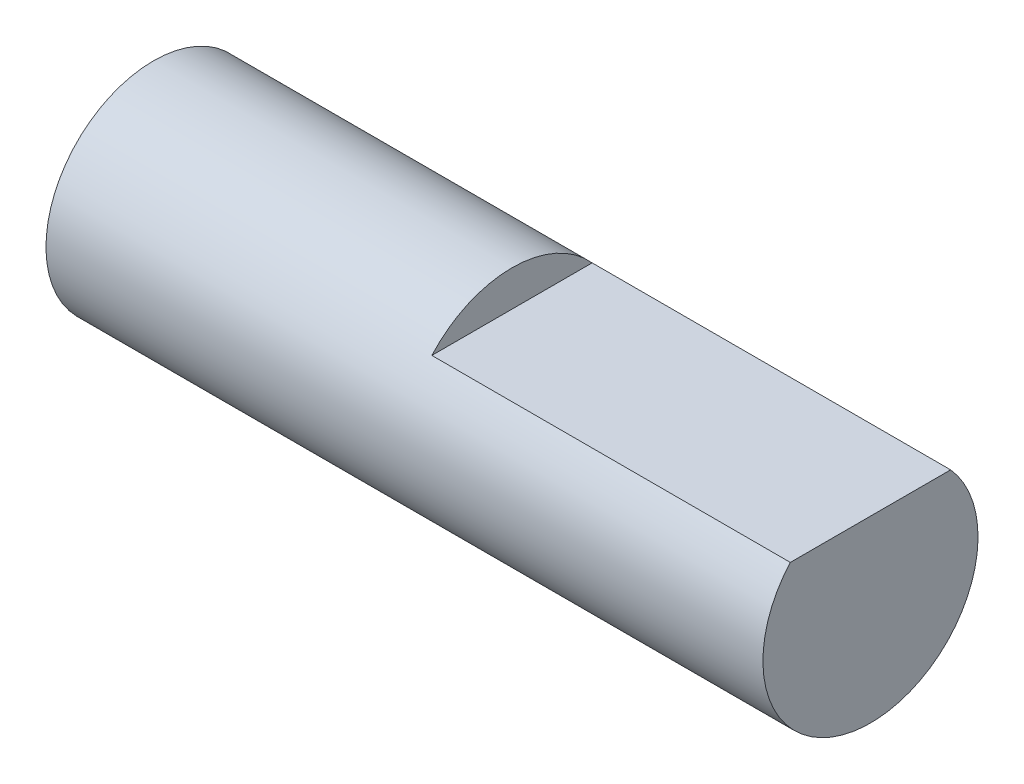
ISO-10303-21;
HEADER;
FILE_DESCRIPTION(('STEP AP214'),'2;1');
FILE_NAME('part.step','',(''),(''),'','','');
FILE_SCHEMA(('AUTOMOTIVE_DESIGN { 1 0 10303 214 1 1 1 1 }'));
ENDSEC;
DATA;
#1=APPLICATION_CONTEXT('core data for automotive mechanical design processes');
#2=APPLICATION_PROTOCOL_DEFINITION('international standard','automotive_design',2000,#1);
#3=PRODUCT_CONTEXT('',#1,'mechanical');
#4=PRODUCT('Part','Part','',(#3));
#5=PRODUCT_RELATED_PRODUCT_CATEGORY('part','',(#4));
#6=PRODUCT_DEFINITION_FORMATION('','',#4);
#7=PRODUCT_DEFINITION_CONTEXT('part definition',#1,'design');
#8=PRODUCT_DEFINITION('design','',#6,#7);
#9=PRODUCT_DEFINITION_SHAPE('','',#8);
#10=(LENGTH_UNIT() NAMED_UNIT(*) SI_UNIT(.MILLI.,.METRE.));
#11=(NAMED_UNIT(*) PLANE_ANGLE_UNIT() SI_UNIT($,.RADIAN.));
#12=(NAMED_UNIT(*) SI_UNIT($,.STERADIAN.) SOLID_ANGLE_UNIT());
#13=UNCERTAINTY_MEASURE_WITH_UNIT(LENGTH_MEASURE(1.E-05),#10,'distance_accuracy_value','');
#14=(GEOMETRIC_REPRESENTATION_CONTEXT(3) GLOBAL_UNCERTAINTY_ASSIGNED_CONTEXT((#13)) GLOBAL_UNIT_ASSIGNED_CONTEXT((#10,
#11,#12)) REPRESENTATION_CONTEXT('',''));
#15=CARTESIAN_POINT('',(0.,0.,0.));
#16=DIRECTION('',(0.,0.,1.));
#17=DIRECTION('',(1.,0.,0.));
#18=AXIS2_PLACEMENT_3D('',#15,#16,#17);
#19=CARTESIAN_POINT('',(20.,0.,0.));
#20=DIRECTION('',(-1.,0.,0.));
#21=DIRECTION('',(0.,0.,1.));
#22=AXIS2_PLACEMENT_3D('',#19,#20,#21);
#23=CYLINDRICAL_SURFACE('',#22,3.);
#24=CARTESIAN_POINT('',(20.,0.,0.));
#25=DIRECTION('',(1.,0.,0.));
#26=DIRECTION('',(0.,0.,-1.));
#27=AXIS2_PLACEMENT_3D('',#24,#25,#26);
#28=CIRCLE('',#27,3.);
#29=CARTESIAN_POINT('',(20.,2.,2.23606797749979));
#30=VERTEX_POINT('',#29);
#31=CARTESIAN_POINT('',(20.,2.,-2.23606797749979));
#32=VERTEX_POINT('',#31);
#33=EDGE_CURVE('E11',#30,#32,#28,.T.);
#34=ORIENTED_EDGE('',*,*,#33,.F.);
#35=DIRECTION('',(1.,0.,0.));
#36=VECTOR('',#35,1.);
#37=CARTESIAN_POINT('',(10.,2.,2.23606797749979));
#38=LINE('',#37,#36);
#39=CARTESIAN_POINT('',(10.,2.,2.23606797749979));
#40=VERTEX_POINT('',#39);
#41=EDGE_CURVE('E46',#40,#30,#38,.T.);
#42=ORIENTED_EDGE('',*,*,#41,.F.);
#43=CARTESIAN_POINT('',(10.,0.,0.));
#44=DIRECTION('',(1.,0.,0.));
#45=DIRECTION('',(0.,0.,-1.));
#46=AXIS2_PLACEMENT_3D('',#43,#44,#45);
#47=CIRCLE('',#46,3.);
#48=CARTESIAN_POINT('',(10.,2.,-2.23606797749979));
#49=VERTEX_POINT('',#48);
#50=EDGE_CURVE('E61',#49,#40,#47,.T.);
#51=ORIENTED_EDGE('',*,*,#50,.F.);
#52=DIRECTION('',(1.,0.,0.));
#53=VECTOR('',#52,1.);
#54=CARTESIAN_POINT('',(10.,2.,-2.23606797749979));
#55=LINE('',#54,#53);
#56=EDGE_CURVE('E52',#49,#32,#55,.T.);
#57=ORIENTED_EDGE('',*,*,#56,.T.);
#58=EDGE_LOOP('',(#34,#42,#51,#57));
#59=FACE_BOUND('',#58,.T.);
#60=CARTESIAN_POINT('',(0.,0.,0.));
#61=DIRECTION('',(1.,0.,0.));
#62=DIRECTION('',(0.,0.,-1.));
#63=AXIS2_PLACEMENT_3D('',#60,#61,#62);
#64=CIRCLE('',#63,3.);
#65=CARTESIAN_POINT('',(0.,0.,-3.));
#66=VERTEX_POINT('',#65);
#67=EDGE_CURVE('E35',#66,#66,#64,.T.);
#68=ORIENTED_EDGE('',*,*,#67,.T.);
#69=EDGE_LOOP('',(#68));
#70=FACE_BOUND('',#69,.T.);
#71=ADVANCED_FACE('F32',(#59,#70),#23,.T.);
#72=CARTESIAN_POINT('',(20.,0.,0.));
#73=DIRECTION('',(1.,0.,0.));
#74=DIRECTION('',(0.,0.,-1.));
#75=AXIS2_PLACEMENT_3D('',#72,#73,#74);
#76=PLANE('',#75);
#77=DIRECTION('',(0.,0.,-1.));
#78=VECTOR('',#77,1.);
#79=CARTESIAN_POINT('',(20.,2.,2.23606797749979));
#80=LINE('',#79,#78);
#81=EDGE_CURVE('E57',#30,#32,#80,.T.);
#82=ORIENTED_EDGE('',*,*,#81,.F.);
#83=ORIENTED_EDGE('',*,*,#33,.T.);
#84=EDGE_LOOP('',(#82,#83));
#85=FACE_BOUND('',#84,.T.);
#86=ADVANCED_FACE('F67',(#85),#76,.T.);
#87=CARTESIAN_POINT('',(0.,0.,0.));
#88=DIRECTION('',(1.,0.,0.));
#89=DIRECTION('',(0.,0.,-1.));
#90=AXIS2_PLACEMENT_3D('',#87,#88,#89);
#91=PLANE('',#90);
#92=ORIENTED_EDGE('',*,*,#67,.F.);
#93=EDGE_LOOP('',(#92));
#94=FACE_BOUND('',#93,.T.);
#95=ADVANCED_FACE('F69',(#94),#91,.F.);
#96=CARTESIAN_POINT('',(10.,2.,2.23606797749979));
#97=DIRECTION('',(0.,-1.,0.));
#98=DIRECTION('',(0.,0.,-1.));
#99=AXIS2_PLACEMENT_3D('',#96,#97,#98);
#100=PLANE('',#99);
#101=ORIENTED_EDGE('',*,*,#81,.T.);
#102=ORIENTED_EDGE('',*,*,#56,.F.);
#103=DIRECTION('',(0.,0.,-1.));
#104=VECTOR('',#103,1.);
#105=CARTESIAN_POINT('',(10.,2.,2.23606797749979));
#106=LINE('',#105,#104);
#107=EDGE_CURVE('E84',#40,#49,#106,.T.);
#108=ORIENTED_EDGE('',*,*,#107,.F.);
#109=ORIENTED_EDGE('',*,*,#41,.T.);
#110=EDGE_LOOP('',(#101,#102,#108,#109));
#111=FACE_BOUND('',#110,.T.);
#112=ADVANCED_FACE('F58',(#111),#100,.F.);
#113=CARTESIAN_POINT('',(10.,0.,0.));
#114=DIRECTION('',(1.,0.,0.));
#115=DIRECTION('',(0.,0.,-1.));
#116=AXIS2_PLACEMENT_3D('',#113,#114,#115);
#117=PLANE('',#116);
#118=ORIENTED_EDGE('',*,*,#50,.T.);
#119=ORIENTED_EDGE('',*,*,#107,.T.);
#120=EDGE_LOOP('',(#118,#119));
#121=FACE_BOUND('',#120,.T.);
#122=ADVANCED_FACE('F79',(#121),#117,.T.);
#123=CLOSED_SHELL('',(#71,#86,#95,#112,#122));
#124=MANIFOLD_SOLID_BREP('B2',#123);
#125=ADVANCED_BREP_SHAPE_REPRESENTATION('',(#18,#124),#14);
#126=SHAPE_DEFINITION_REPRESENTATION(#9,#125);
ENDSEC;
END-ISO-10303-21;
